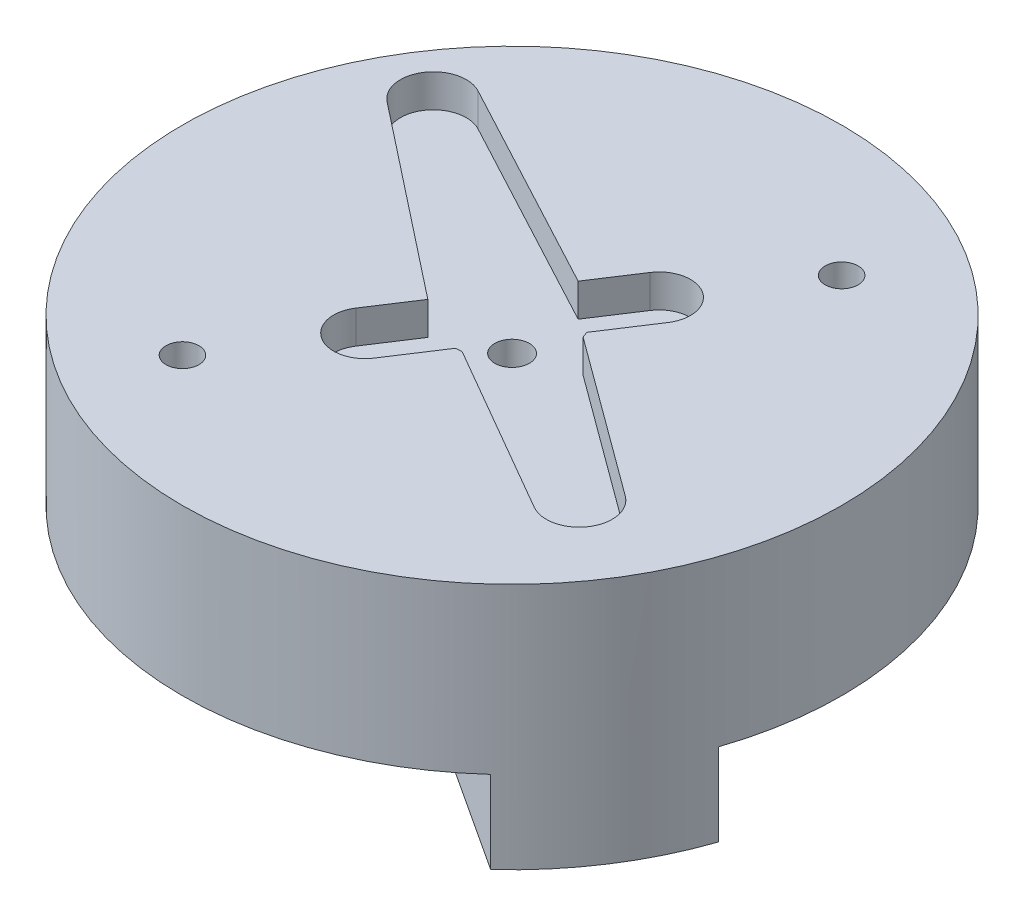
ISO-10303-21;
HEADER;
FILE_DESCRIPTION(('STEP AP214'),'2;1');
FILE_NAME('part.step','',(''),(''),'','','');
FILE_SCHEMA(('AUTOMOTIVE_DESIGN { 1 0 10303 214 1 1 1 1 }'));
ENDSEC;
DATA;
#1=APPLICATION_CONTEXT('core data for automotive mechanical design processes');
#2=APPLICATION_PROTOCOL_DEFINITION('international standard','automotive_design',2000,#1);
#3=PRODUCT_CONTEXT('',#1,'mechanical');
#4=PRODUCT('Part','Part','',(#3));
#5=PRODUCT_RELATED_PRODUCT_CATEGORY('part','',(#4));
#6=PRODUCT_DEFINITION_FORMATION('','',#4);
#7=PRODUCT_DEFINITION_CONTEXT('part definition',#1,'design');
#8=PRODUCT_DEFINITION('design','',#6,#7);
#9=PRODUCT_DEFINITION_SHAPE('','',#8);
#10=(LENGTH_UNIT() NAMED_UNIT(*) SI_UNIT(.MILLI.,.METRE.));
#11=(NAMED_UNIT(*) PLANE_ANGLE_UNIT() SI_UNIT($,.RADIAN.));
#12=(NAMED_UNIT(*) SI_UNIT($,.STERADIAN.) SOLID_ANGLE_UNIT());
#13=UNCERTAINTY_MEASURE_WITH_UNIT(LENGTH_MEASURE(1.E-05),#10,'distance_accuracy_value','');
#14=(GEOMETRIC_REPRESENTATION_CONTEXT(3) GLOBAL_UNCERTAINTY_ASSIGNED_CONTEXT((#13)) GLOBAL_UNIT_ASSIGNED_CONTEXT((#10,
#11,#12)) REPRESENTATION_CONTEXT('',''));
#15=CARTESIAN_POINT('',(0.,0.,0.));
#16=DIRECTION('',(0.,0.,1.));
#17=DIRECTION('',(1.,0.,0.));
#18=AXIS2_PLACEMENT_3D('',#15,#16,#17);
#19=CARTESIAN_POINT('',(-25.6510589348685,-8.,9.08811472367193));
#20=DIRECTION('',(0.,1.,0.));
#21=DIRECTION('',(0.,0.,1.));
#22=AXIS2_PLACEMENT_3D('',#19,#20,#21);
#23=CYLINDRICAL_SURFACE('',#22,2.3);
#24=CARTESIAN_POINT('',(-25.6510589348685,-8.,9.08811472367193));
#25=DIRECTION('',(0.,-1.,0.));
#26=DIRECTION('',(0.,0.,-1.));
#27=AXIS2_PLACEMENT_3D('',#24,#25,#26);
#28=CIRCLE('',#27,2.3);
#29=CARTESIAN_POINT('',(-27.5765478748303,-8.,7.83014320488275));
#30=VERTEX_POINT('',#29);
#31=CARTESIAN_POINT('',(-23.7255699949067,-8.,10.3460862424611));
#32=VERTEX_POINT('',#31);
#33=EDGE_CURVE('E253',#30,#32,#28,.T.);
#34=ORIENTED_EDGE('',*,*,#33,.T.);
#35=EDGE_CURVE('E252',#32,#30,#28,.T.);
#36=ORIENTED_EDGE('',*,*,#35,.T.);
#37=EDGE_LOOP('',(#34,#36));
#38=FACE_BOUND('',#37,.T.);
#39=CARTESIAN_POINT('',(-25.6510589348685,-2.,9.08811472367193));
#40=DIRECTION('',(0.,1.,0.));
#41=DIRECTION('',(0.,0.,1.));
#42=AXIS2_PLACEMENT_3D('',#39,#40,#41);
#43=CIRCLE('',#42,2.30000000000001);
#44=CARTESIAN_POINT('',(-25.6510589348685,-2.,11.3881147236719));
#45=VERTEX_POINT('',#44);
#46=EDGE_CURVE('E761',#45,#45,#43,.T.);
#47=ORIENTED_EDGE('',*,*,#46,.T.);
#48=EDGE_LOOP('',(#47));
#49=FACE_BOUND('',#48,.T.);
#50=ADVANCED_FACE('F38',(#38,#49),#23,.F.);
#51=CARTESIAN_POINT('',(-25.6510589348685,-8.,9.08811472367193));
#52=DIRECTION('',(0.,-1.,0.));
#53=DIRECTION('',(0.,0.,-1.));
#54=AXIS2_PLACEMENT_3D('',#51,#52,#53);
#55=PLANE('',#54);
#56=CARTESIAN_POINT('',(-17.7477161320408,-8.,-3.00897883391423));
#57=DIRECTION('',(0.,-1.,0.));
#58=DIRECTION('',(0.,0.,-1.));
#59=AXIS2_PLACEMENT_3D('',#56,#57,#58);
#60=CIRCLE('',#59,1.);
#61=CARTESIAN_POINT('',(-17.7477161320408,-8.,-4.00897883391424));
#62=VERTEX_POINT('',#61);
#63=EDGE_CURVE('E259',#62,#62,#60,.T.);
#64=ORIENTED_EDGE('',*,*,#63,.F.);
#65=EDGE_LOOP('',(#64));
#66=FACE_BOUND('',#65,.T.);
#67=CARTESIAN_POINT('',(-25.6510589348685,-8.,9.08811472367193));
#68=DIRECTION('',(0.,-1.,0.));
#69=DIRECTION('',(0.,0.,-1.));
#70=AXIS2_PLACEMENT_3D('',#67,#68,#69);
#71=CIRCLE('',#70,20.);
#72=CARTESIAN_POINT('',(-39.1280482370195,-8.,-5.68925849857922));
#73=VERTEX_POINT('',#72);
#74=CARTESIAN_POINT('',(-6.70462824667751,-8.,15.4937969026109));
#75=VERTEX_POINT('',#74);
#76=EDGE_CURVE('E263',#73,#75,#71,.T.);
#77=ORIENTED_EDGE('',*,*,#76,.T.);
#78=DIRECTION('',(0.837169104331222,0.,0.546944138603988));
#79=VECTOR('',#78,1.);
#80=CARTESIAN_POINT('',(-20.9908493018867,-8.,6.160240720805));
#81=LINE('',#80,#79);
#82=CARTESIAN_POINT('',(-20.9908493018867,-8.,6.160240720805));
#83=VERTEX_POINT('',#82);
#84=EDGE_CURVE('E219',#83,#75,#81,.T.);
#85=ORIENTED_EDGE('',*,*,#84,.F.);
#86=DIRECTION('',(0.546944138603988,0.,-0.837169104331222));
#87=VECTOR('',#86,1.);
#88=CARTESIAN_POINT('',(-23.7255699949067,-8.,10.3460862424611));
#89=LINE('',#88,#87);
#90=EDGE_CURVE('E753',#32,#83,#89,.T.);
#91=ORIENTED_EDGE('',*,*,#90,.F.);
#92=ORIENTED_EDGE('',*,*,#33,.F.);
#93=DIRECTION('',(-0.546944138603989,0.,0.837169104331222));
#94=VECTOR('',#93,1.);
#95=CARTESIAN_POINT('',(-27.5765478748303,-8.,7.83014320488276));
#96=LINE('',#95,#94);
#97=CARTESIAN_POINT('',(-24.8418271818103,-8.,3.64429768322665));
#98=VERTEX_POINT('',#97);
#99=EDGE_CURVE('E48',#98,#30,#96,.T.);
#100=ORIENTED_EDGE('',*,*,#99,.F.);
#101=DIRECTION('',(0.837169104331222,0.,0.546944138603989));
#102=VECTOR('',#101,1.);
#103=CARTESIAN_POINT('',(-24.8418271818103,-8.,3.64429768322665));
#104=LINE('',#103,#102);
#105=EDGE_CURVE('E222',#73,#98,#104,.T.);
#106=ORIENTED_EDGE('',*,*,#105,.F.);
#107=EDGE_LOOP('',(#77,#85,#91,#92,#100,#106));
#108=FACE_BOUND('',#107,.T.);
#109=ADVANCED_FACE('F453',(#66,#108),#55,.T.);
#110=CARTESIAN_POINT('',(-33.5544017376961,-8.,21.1852082812581));
#111=DIRECTION('',(0.,-1.,0.));
#112=DIRECTION('',(0.,0.,-1.));
#113=AXIS2_PLACEMENT_3D('',#110,#111,#112);
#114=CIRCLE('',#113,0.999999999999998);
#115=CARTESIAN_POINT('',(-33.5544017376961,-8.,20.1852082812581));
#116=VERTEX_POINT('',#115);
#117=EDGE_CURVE('E256',#116,#116,#114,.T.);
#118=ORIENTED_EDGE('',*,*,#117,.F.);
#119=EDGE_LOOP('',(#118));
#120=FACE_BOUND('',#119,.T.);
#121=CARTESIAN_POINT('',(-26.4602906879266,-8.,14.5319317641172));
#122=VERTEX_POINT('',#121);
#123=EDGE_CURVE('E215',#122,#32,#89,.T.);
#124=ORIENTED_EDGE('',*,*,#123,.F.);
#125=DIRECTION('',(-0.837169104331222,0.,-0.546944138603989));
#126=VECTOR('',#125,1.);
#127=CARTESIAN_POINT('',(-26.4602906879266,-8.,14.5319317641172));
#128=LINE('',#127,#126);
#129=CARTESIAN_POINT('',(-12.1740696327174,-8.,23.8654879459231));
#130=VERTEX_POINT('',#129);
#131=EDGE_CURVE('E751',#130,#122,#128,.T.);
#132=ORIENTED_EDGE('',*,*,#131,.F.);
#133=CARTESIAN_POINT('',(-44.5974896230594,-8.,2.68243254473301));
#134=VERTEX_POINT('',#133);
#135=EDGE_CURVE('E262',#130,#134,#71,.T.);
#136=ORIENTED_EDGE('',*,*,#135,.T.);
#137=DIRECTION('',(-0.837169104331223,0.,-0.546944138603988));
#138=VECTOR('',#137,1.);
#139=CARTESIAN_POINT('',(-30.3112685678502,-8.,12.0159887265389));
#140=LINE('',#139,#138);
#141=CARTESIAN_POINT('',(-30.3112685678502,-8.,12.0159887265389));
#142=VERTEX_POINT('',#141);
#143=EDGE_CURVE('E63',#142,#134,#140,.T.);
#144=ORIENTED_EDGE('',*,*,#143,.F.);
#145=EDGE_CURVE('E11',#30,#142,#96,.T.);
#146=ORIENTED_EDGE('',*,*,#145,.F.);
#147=ORIENTED_EDGE('',*,*,#35,.F.);
#148=EDGE_LOOP('',(#124,#132,#136,#144,#146,#147));
#149=FACE_BOUND('',#148,.T.);
#150=ADVANCED_FACE('F459',(#120,#149),#55,.T.);
#151=CARTESIAN_POINT('',(-22.1232692408727,2.,3.68837400073555));
#152=DIRECTION('',(0.,-1.,0.));
#153=DIRECTION('',(0.,0.,-1.));
#154=AXIS2_PLACEMENT_3D('',#151,#152,#153);
#155=CYLINDRICAL_SURFACE('',#154,1.89999999999997);
#156=CARTESIAN_POINT('',(-22.1232692408727,0.,3.68837400073555));
#157=DIRECTION('',(0.,1.,0.));
#158=DIRECTION('',(0.,0.,1.));
#159=AXIS2_PLACEMENT_3D('',#156,#157,#158);
#160=CIRCLE('',#159,1.89999999999997);
#161=CARTESIAN_POINT('',(-20.5326479426435,0.,4.7275678640831));
#162=VERTEX_POINT('',#161);
#163=CARTESIAN_POINT('',(-23.7138905391021,0.,2.64918013738797));
#164=VERTEX_POINT('',#163);
#165=EDGE_CURVE('E265',#162,#164,#160,.T.);
#166=ORIENTED_EDGE('',*,*,#165,.F.);
#167=DIRECTION('',(0.,-1.,0.));
#168=VECTOR('',#167,1.);
#169=CARTESIAN_POINT('',(-20.5326479426435,2.,4.7275678640831));
#170=LINE('',#169,#168);
#171=CARTESIAN_POINT('',(-20.5326479426435,2.,4.7275678640831));
#172=VERTEX_POINT('',#171);
#173=EDGE_CURVE('E42',#172,#162,#170,.T.);
#174=ORIENTED_EDGE('',*,*,#173,.F.);
#175=CARTESIAN_POINT('',(-22.1232692408727,2.,3.68837400073555));
#176=DIRECTION('',(0.,1.,0.));
#177=DIRECTION('',(0.,0.,1.));
#178=AXIS2_PLACEMENT_3D('',#175,#176,#177);
#179=CIRCLE('',#178,1.89999999999997);
#180=CARTESIAN_POINT('',(-23.7138905391021,2.,2.64918013738797));
#181=VERTEX_POINT('',#180);
#182=EDGE_CURVE('E273',#172,#181,#179,.T.);
#183=ORIENTED_EDGE('',*,*,#182,.T.);
#184=DIRECTION('',(0.,-1.,0.));
#185=VECTOR('',#184,1.);
#186=CARTESIAN_POINT('',(-23.7138905391021,2.,2.64918013738797));
#187=LINE('',#186,#185);
#188=EDGE_CURVE('E317',#181,#164,#187,.T.);
#189=ORIENTED_EDGE('',*,*,#188,.T.);
#190=EDGE_LOOP('',(#166,#174,#183,#189));
#191=FACE_BOUND('',#190,.T.);
#192=ADVANCED_FACE('F406',(#191),#155,.F.);
#193=CARTESIAN_POINT('',(-12.225668462111,2.,-7.98734409962373));
#194=DIRECTION('',(-0.837169104331222,0.,-0.546944138603988));
#195=DIRECTION('',(-0.546944138603988,0.,0.837169104331222));
#196=AXIS2_PLACEMENT_3D('',#193,#194,#195);
#197=PLANE('',#196);
#198=DIRECTION('',(0.546944138603988,0.,-0.837169104331222));
#199=VECTOR('',#198,1.);
#200=CARTESIAN_POINT('',(-12.225668462111,0.,-7.98734409962373));
#201=LINE('',#200,#199);
#202=CARTESIAN_POINT('',(-22.4854189433941,0.,7.71653773189272));
#203=VERTEX_POINT('',#202);
#204=EDGE_CURVE('E320',#203,#162,#201,.T.);
#205=ORIENTED_EDGE('',*,*,#204,.F.);
#206=DIRECTION('',(0.,-1.,0.));
#207=VECTOR('',#206,1.);
#208=CARTESIAN_POINT('',(-22.4854189433941,2.,7.71653773189272));
#209=LINE('',#208,#207);
#210=CARTESIAN_POINT('',(-22.4854189433941,2.,7.71653773189272));
#211=VERTEX_POINT('',#210);
#212=EDGE_CURVE('E380',#211,#203,#209,.T.);
#213=ORIENTED_EDGE('',*,*,#212,.F.);
#214=DIRECTION('',(0.546944138603988,0.,-0.837169104331222));
#215=VECTOR('',#214,1.);
#216=CARTESIAN_POINT('',(-12.225668462111,2.,-7.98734409962373));
#217=LINE('',#216,#215);
#218=EDGE_CURVE('E276',#211,#172,#217,.T.);
#219=ORIENTED_EDGE('',*,*,#218,.T.);
#220=ORIENTED_EDGE('',*,*,#173,.T.);
#221=EDGE_LOOP('',(#205,#213,#219,#220));
#222=FACE_BOUND('',#221,.T.);
#223=ADVANCED_FACE('F386',(#222),#197,.T.);
#224=CARTESIAN_POINT('',(-22.3010554179395,2.,8.21690854366014));
#225=DIRECTION('',(-0.938333149525754,0.,0.345732411701709));
#226=DIRECTION('',(0.345732411701709,0.,0.938333149525754));
#227=AXIS2_PLACEMENT_3D('',#224,#225,#226);
#228=PLANE('',#227);
#229=DIRECTION('',(-0.345732411701709,0.,-0.938333149525754));
#230=VECTOR('',#229,1.);
#231=CARTESIAN_POINT('',(-22.3010554179395,0.,8.21690854366014));
#232=LINE('',#231,#230);
#233=CARTESIAN_POINT('',(-22.3522899696132,0.,8.07785569061723));
#234=VERTEX_POINT('',#233);
#235=EDGE_CURVE('E323',#234,#203,#232,.T.);
#236=ORIENTED_EDGE('',*,*,#235,.F.);
#237=DIRECTION('',(0.,-1.,0.));
#238=VECTOR('',#237,1.);
#239=CARTESIAN_POINT('',(-22.3522899696132,2.,8.07785569061723));
#240=LINE('',#239,#238);
#241=CARTESIAN_POINT('',(-22.3522899696132,2.,8.07785569061723));
#242=VERTEX_POINT('',#241);
#243=EDGE_CURVE('E379',#242,#234,#240,.T.);
#244=ORIENTED_EDGE('',*,*,#243,.F.);
#245=DIRECTION('',(-0.345732411701709,0.,-0.938333149525754));
#246=VECTOR('',#245,1.);
#247=CARTESIAN_POINT('',(-22.3010554179395,2.,8.21690854366014));
#248=LINE('',#247,#246);
#249=EDGE_CURVE('E279',#242,#211,#248,.T.);
#250=ORIENTED_EDGE('',*,*,#249,.T.);
#251=ORIENTED_EDGE('',*,*,#212,.T.);
#252=EDGE_LOOP('',(#236,#244,#250,#251));
#253=FACE_BOUND('',#252,.T.);
#254=ADVANCED_FACE('F394',(#253),#228,.T.);
#255=CARTESIAN_POINT('',(-11.6820319266895,2.,15.9117216725028));
#256=DIRECTION('',(0.591806202277593,0.,-0.806080280707681));
#257=DIRECTION('',(-0.806080280707681,0.,-0.591806202277593));
#258=AXIS2_PLACEMENT_3D('',#255,#256,#257);
#259=PLANE('',#258);
#260=DIRECTION('',(0.806080280707681,0.,0.591806202277593));
#261=VECTOR('',#260,1.);
#262=CARTESIAN_POINT('',(-11.6820319266895,0.,15.9117216725028));
#263=LINE('',#262,#261);
#264=CARTESIAN_POINT('',(-12.7052206144597,0.,15.1605193096425));
#265=VERTEX_POINT('',#264);
#266=EDGE_CURVE('E326',#234,#265,#263,.T.);
#267=ORIENTED_EDGE('',*,*,#266,.T.);
#268=DIRECTION('',(0.,-1.,0.));
#269=VECTOR('',#268,1.);
#270=CARTESIAN_POINT('',(-12.7052206144597,2.,15.1605193096425));
#271=LINE('',#270,#269);
#272=CARTESIAN_POINT('',(-12.7052206144597,2.,15.1605193096425));
#273=VERTEX_POINT('',#272);
#274=EDGE_CURVE('E377',#273,#265,#271,.T.);
#275=ORIENTED_EDGE('',*,*,#274,.F.);
#276=DIRECTION('',(0.806080280707681,0.,0.591806202277593));
#277=VECTOR('',#276,1.);
#278=CARTESIAN_POINT('',(-11.6820319266895,2.,15.9117216725028));
#279=LINE('',#278,#277);
#280=EDGE_CURVE('E282',#242,#273,#279,.T.);
#281=ORIENTED_EDGE('',*,*,#280,.F.);
#282=ORIENTED_EDGE('',*,*,#243,.T.);
#283=EDGE_LOOP('',(#267,#275,#281,#282));
#284=FACE_BOUND('',#283,.T.);
#285=ADVANCED_FACE('F399',(#284),#259,.F.);
#286=CARTESIAN_POINT('',(-13.8888330190148,2.,16.772679871058));
#287=DIRECTION('',(0.,-1.,0.));
#288=DIRECTION('',(0.,0.,-1.));
#289=AXIS2_PLACEMENT_3D('',#286,#287,#288);
#290=CYLINDRICAL_SURFACE('',#289,2.00000000000003);
#291=CARTESIAN_POINT('',(-13.8888330190148,0.,16.772679871058));
#292=DIRECTION('',(0.,1.,0.));
#293=DIRECTION('',(0.,0.,1.));
#294=AXIS2_PLACEMENT_3D('',#291,#292,#293);
#295=CIRCLE('',#294,2.00000000000003);
#296=CARTESIAN_POINT('',(-14.889738344747,0.,18.5042076730066));
#297=VERTEX_POINT('',#296);
#298=EDGE_CURVE('E329',#297,#265,#295,.T.);
#299=ORIENTED_EDGE('',*,*,#298,.F.);
#300=DIRECTION('',(0.,-1.,0.));
#301=VECTOR('',#300,1.);
#302=CARTESIAN_POINT('',(-14.889738344747,2.,18.5042076730066));
#303=LINE('',#302,#301);
#304=CARTESIAN_POINT('',(-14.889738344747,2.,18.5042076730066));
#305=VERTEX_POINT('',#304);
#306=EDGE_CURVE('E375',#305,#297,#303,.T.);
#307=ORIENTED_EDGE('',*,*,#306,.F.);
#308=CARTESIAN_POINT('',(-13.8888330190148,2.,16.772679871058));
#309=DIRECTION('',(0.,1.,0.));
#310=DIRECTION('',(0.,0.,1.));
#311=AXIS2_PLACEMENT_3D('',#308,#309,#310);
#312=CIRCLE('',#311,2.00000000000003);
#313=EDGE_CURVE('E284',#305,#273,#312,.T.);
#314=ORIENTED_EDGE('',*,*,#313,.T.);
#315=ORIENTED_EDGE('',*,*,#274,.T.);
#316=EDGE_LOOP('',(#299,#307,#314,#315));
#317=FACE_BOUND('',#316,.T.);
#318=ADVANCED_FACE('F443',(#317),#290,.F.);
#319=CARTESIAN_POINT('',(-11.7465669620987,2.,20.3211100484931));
#320=DIRECTION('',(0.500452662866061,0.,-0.865763900974318));
#321=DIRECTION('',(-0.865763900974318,0.,-0.500452662866061));
#322=AXIS2_PLACEMENT_3D('',#319,#320,#321);
#323=PLANE('',#322);
#324=DIRECTION('',(0.865763900974318,0.,0.500452662866061));
#325=VECTOR('',#324,1.);
#326=CARTESIAN_POINT('',(-11.7465669620987,0.,20.3211100484931));
#327=LINE('',#326,#325);
#328=CARTESIAN_POINT('',(-25.2510939042143,0.,12.5148519435728));
#329=VERTEX_POINT('',#328);
#330=EDGE_CURVE('E332',#329,#297,#327,.T.);
#331=ORIENTED_EDGE('',*,*,#330,.F.);
#332=DIRECTION('',(0.,-1.,0.));
#333=VECTOR('',#332,1.);
#334=CARTESIAN_POINT('',(-25.2510939042143,2.,12.5148519435728));
#335=LINE('',#334,#333);
#336=CARTESIAN_POINT('',(-25.2510939042143,2.,12.5148519435728));
#337=VERTEX_POINT('',#336);
#338=EDGE_CURVE('E373',#337,#329,#335,.T.);
#339=ORIENTED_EDGE('',*,*,#338,.F.);
#340=DIRECTION('',(0.865763900974318,0.,0.500452662866061));
#341=VECTOR('',#340,1.);
#342=CARTESIAN_POINT('',(-11.7465669620987,2.,20.3211100484931));
#343=LINE('',#342,#341);
#344=EDGE_CURVE('E287',#337,#305,#343,.T.);
#345=ORIENTED_EDGE('',*,*,#344,.T.);
#346=ORIENTED_EDGE('',*,*,#306,.T.);
#347=EDGE_LOOP('',(#331,#339,#345,#346));
#348=FACE_BOUND('',#347,.T.);
#349=ADVANCED_FACE('F440',(#348),#323,.T.);
#350=CARTESIAN_POINT('',(0.661656361916206,2.,10.9489122740211));
#351=DIRECTION('',(-0.0603211973437465,0.,-0.998179018588859));
#352=DIRECTION('',(-0.998179018588859,0.,0.0603211973437465));
#353=AXIS2_PLACEMENT_3D('',#350,#351,#352);
#354=PLANE('',#353);
#355=DIRECTION('',(0.998179018588859,0.,-0.0603211973437465));
#356=VECTOR('',#355,1.);
#357=CARTESIAN_POINT('',(0.661656361916206,0.,10.9489122740211));
#358=LINE('',#357,#356);
#359=CARTESIAN_POINT('',(-25.6354563298842,0.,12.5380794421463));
#360=VERTEX_POINT('',#359);
#361=EDGE_CURVE('E335',#360,#329,#358,.T.);
#362=ORIENTED_EDGE('',*,*,#361,.F.);
#363=DIRECTION('',(0.,-1.,0.));
#364=VECTOR('',#363,1.);
#365=CARTESIAN_POINT('',(-25.6354563298842,2.,12.5380794421463));
#366=LINE('',#365,#364);
#367=CARTESIAN_POINT('',(-25.6354563298842,2.,12.5380794421463));
#368=VERTEX_POINT('',#367);
#369=EDGE_CURVE('E371',#368,#360,#366,.T.);
#370=ORIENTED_EDGE('',*,*,#369,.F.);
#371=DIRECTION('',(0.998179018588859,0.,-0.0603211973437465));
#372=VECTOR('',#371,1.);
#373=CARTESIAN_POINT('',(0.661656361916206,2.,10.9489122740211));
#374=LINE('',#373,#372);
#375=EDGE_CURVE('E290',#368,#337,#374,.T.);
#376=ORIENTED_EDGE('',*,*,#375,.T.);
#377=ORIENTED_EDGE('',*,*,#338,.T.);
#378=EDGE_LOOP('',(#362,#370,#376,#377));
#379=FACE_BOUND('',#378,.T.);
#380=ADVANCED_FACE('F436',(#379),#354,.T.);
#381=CARTESIAN_POINT('',(-12.225668462111,2.,-7.9873440996237));
#382=DIRECTION('',(-0.837169104331223,0.,-0.546944138603987));
#383=DIRECTION('',(-0.546944138603987,0.,0.837169104331223));
#384=AXIS2_PLACEMENT_3D('',#381,#382,#383);
#385=PLANE('',#384);
#386=DIRECTION('',(0.546944138603987,0.,-0.837169104331223));
#387=VECTOR('',#386,1.);
#388=CARTESIAN_POINT('',(-12.225668462111,0.,-7.9873440996237));
#389=LINE('',#388,#387);
#390=CARTESIAN_POINT('',(-27.5882273306349,0.,15.5270493099559));
#391=VERTEX_POINT('',#390);
#392=EDGE_CURVE('E338',#391,#360,#389,.T.);
#393=ORIENTED_EDGE('',*,*,#392,.F.);
#394=DIRECTION('',(0.,-1.,0.));
#395=VECTOR('',#394,1.);
#396=CARTESIAN_POINT('',(-27.5882273306349,2.,15.5270493099559));
#397=LINE('',#396,#395);
#398=CARTESIAN_POINT('',(-27.5882273306349,2.,15.5270493099559));
#399=VERTEX_POINT('',#398);
#400=EDGE_CURVE('E369',#399,#391,#397,.T.);
#401=ORIENTED_EDGE('',*,*,#400,.F.);
#402=DIRECTION('',(0.546944138603987,0.,-0.837169104331223));
#403=VECTOR('',#402,1.);
#404=CARTESIAN_POINT('',(-12.225668462111,2.,-7.9873440996237));
#405=LINE('',#404,#403);
#406=EDGE_CURVE('E293',#399,#368,#405,.T.);
#407=ORIENTED_EDGE('',*,*,#406,.T.);
#408=ORIENTED_EDGE('',*,*,#369,.T.);
#409=EDGE_LOOP('',(#393,#401,#407,#408));
#410=FACE_BOUND('',#409,.T.);
#411=ADVANCED_FACE('F432',(#410),#385,.T.);
#412=CARTESIAN_POINT('',(-29.1788486288642,2.,14.4878554466083));
#413=DIRECTION('',(0.,-1.,0.));
#414=DIRECTION('',(0.,0.,-1.));
#415=AXIS2_PLACEMENT_3D('',#412,#413,#414);
#416=CYLINDRICAL_SURFACE('',#415,1.90000000000002);
#417=CARTESIAN_POINT('',(-29.1788486288642,0.,14.4878554466083));
#418=DIRECTION('',(0.,1.,0.));
#419=DIRECTION('',(0.,0.,1.));
#420=AXIS2_PLACEMENT_3D('',#417,#418,#419);
#421=CIRCLE('',#420,1.90000000000002);
#422=CARTESIAN_POINT('',(-30.7694699270935,0.,13.4486615832607));
#423=VERTEX_POINT('',#422);
#424=EDGE_CURVE('E341',#423,#391,#421,.T.);
#425=ORIENTED_EDGE('',*,*,#424,.F.);
#426=DIRECTION('',(0.,-1.,0.));
#427=VECTOR('',#426,1.);
#428=CARTESIAN_POINT('',(-30.7694699270935,2.,13.4486615832607));
#429=LINE('',#428,#427);
#430=CARTESIAN_POINT('',(-30.7694699270935,2.,13.4486615832607));
#431=VERTEX_POINT('',#430);
#432=EDGE_CURVE('E367',#431,#423,#429,.T.);
#433=ORIENTED_EDGE('',*,*,#432,.F.);
#434=CARTESIAN_POINT('',(-29.1788486288642,2.,14.4878554466083));
#435=DIRECTION('',(0.,1.,0.));
#436=DIRECTION('',(0.,0.,1.));
#437=AXIS2_PLACEMENT_3D('',#434,#435,#436);
#438=CIRCLE('',#437,1.90000000000002);
#439=EDGE_CURVE('E296',#431,#399,#438,.T.);
#440=ORIENTED_EDGE('',*,*,#439,.T.);
#441=ORIENTED_EDGE('',*,*,#400,.T.);
#442=EDGE_LOOP('',(#425,#433,#440,#441));
#443=FACE_BOUND('',#442,.T.);
#444=ADVANCED_FACE('F428',(#443),#416,.F.);
#445=CARTESIAN_POINT('',(-15.4069110585695,2.,-10.0657318263189));
#446=DIRECTION('',(0.837169104331219,0.,0.546944138603993));
#447=DIRECTION('',(0.546944138603993,0.,-0.837169104331219));
#448=AXIS2_PLACEMENT_3D('',#445,#446,#447);
#449=PLANE('',#448);
#450=DIRECTION('',(-0.546944138603993,0.,0.837169104331219));
#451=VECTOR('',#450,1.);
#452=CARTESIAN_POINT('',(-15.4069110585695,0.,-10.0657318263189));
#453=LINE('',#452,#451);
#454=CARTESIAN_POINT('',(-29.0440524350782,0.,10.8076858154708));
#455=VERTEX_POINT('',#454);
#456=EDGE_CURVE('E344',#455,#423,#453,.T.);
#457=ORIENTED_EDGE('',*,*,#456,.F.);
#458=DIRECTION('',(0.,-1.,0.));
#459=VECTOR('',#458,1.);
#460=CARTESIAN_POINT('',(-29.0440524350782,2.,10.8076858154708));
#461=LINE('',#460,#459);
#462=CARTESIAN_POINT('',(-29.0440524350782,2.,10.8076858154708));
#463=VERTEX_POINT('',#462);
#464=EDGE_CURVE('E365',#463,#455,#461,.T.);
#465=ORIENTED_EDGE('',*,*,#464,.F.);
#466=DIRECTION('',(-0.546944138603993,0.,0.837169104331219));
#467=VECTOR('',#466,1.);
#468=CARTESIAN_POINT('',(-15.4069110585695,2.,-10.0657318263189));
#469=LINE('',#468,#467);
#470=EDGE_CURVE('E299',#463,#431,#469,.T.);
#471=ORIENTED_EDGE('',*,*,#470,.T.);
#472=ORIENTED_EDGE('',*,*,#432,.T.);
#473=EDGE_LOOP('',(#457,#465,#471,#472));
#474=FACE_BOUND('',#473,.T.);
#475=ADVANCED_FACE('F424',(#474),#449,.T.);
#476=CARTESIAN_POINT('',(-16.3674357638219,2.,20.7884204853247));
#477=DIRECTION('',(0.618608220900555,0.,-0.785699604832693));
#478=DIRECTION('',(-0.785699604832693,0.,-0.618608220900555));
#479=AXIS2_PLACEMENT_3D('',#476,#477,#478);
#480=PLANE('',#479);
#481=DIRECTION('',(0.785699604832693,0.,0.618608220900555));
#482=VECTOR('',#481,1.);
#483=CARTESIAN_POINT('',(-16.3674357638219,0.,20.7884204853247));
#484=LINE('',#483,#482);
#485=CARTESIAN_POINT('',(-40.6597071429182,0.,1.66228285330166));
#486=VERTEX_POINT('',#485);
#487=EDGE_CURVE('E347',#486,#455,#484,.T.);
#488=ORIENTED_EDGE('',*,*,#487,.F.);
#489=DIRECTION('',(0.,-1.,0.));
#490=VECTOR('',#489,1.);
#491=CARTESIAN_POINT('',(-40.6597071429182,2.,1.66228285330166));
#492=LINE('',#491,#490);
#493=CARTESIAN_POINT('',(-40.6597071429182,2.,1.66228285330166));
#494=VERTEX_POINT('',#493);
#495=EDGE_CURVE('E363',#494,#486,#492,.T.);
#496=ORIENTED_EDGE('',*,*,#495,.F.);
#497=DIRECTION('',(0.785699604832693,0.,0.618608220900555));
#498=VECTOR('',#497,1.);
#499=CARTESIAN_POINT('',(-16.3674357638219,2.,20.7884204853247));
#500=LINE('',#499,#498);
#501=EDGE_CURVE('E302',#494,#463,#500,.T.);
#502=ORIENTED_EDGE('',*,*,#501,.T.);
#503=ORIENTED_EDGE('',*,*,#464,.T.);
#504=EDGE_LOOP('',(#488,#496,#502,#503));
#505=FACE_BOUND('',#504,.T.);
#506=ADVANCED_FACE('F420',(#505),#480,.T.);
#507=CARTESIAN_POINT('',(-39.4224907011171,2.,0.0908836436363104));
#508=DIRECTION('',(0.,-1.,0.));
#509=DIRECTION('',(0.,0.,-1.));
#510=AXIS2_PLACEMENT_3D('',#507,#508,#509);
#511=CYLINDRICAL_SURFACE('',#510,2.00000000000001);
#512=CARTESIAN_POINT('',(-39.4224907011171,0.,0.0908836436363104));
#513=DIRECTION('',(0.,1.,0.));
#514=DIRECTION('',(0.,0.,1.));
#515=AXIS2_PLACEMENT_3D('',#512,#513,#514);
#516=CIRCLE('',#515,2.00000000000001);
#517=CARTESIAN_POINT('',(-38.4804463447337,0.,-1.67335909210226));
#518=VERTEX_POINT('',#517);
#519=EDGE_CURVE('E350',#518,#486,#516,.T.);
#520=ORIENTED_EDGE('',*,*,#519,.F.);
#521=DIRECTION('',(0.,-1.,0.));
#522=VECTOR('',#521,1.);
#523=CARTESIAN_POINT('',(-38.4804463447337,2.,-1.67335909210226));
#524=LINE('',#523,#522);
#525=CARTESIAN_POINT('',(-38.4804463447337,2.,-1.67335909210226));
#526=VERTEX_POINT('',#525);
#527=EDGE_CURVE('E361',#526,#518,#524,.T.);
#528=ORIENTED_EDGE('',*,*,#527,.F.);
#529=CARTESIAN_POINT('',(-39.4224907011171,2.,0.0908836436363104));
#530=DIRECTION('',(0.,1.,0.));
#531=DIRECTION('',(0.,0.,1.));
#532=AXIS2_PLACEMENT_3D('',#529,#530,#531);
#533=CIRCLE('',#532,2.00000000000001);
#534=EDGE_CURVE('E305',#526,#494,#533,.T.);
#535=ORIENTED_EDGE('',*,*,#534,.T.);
#536=ORIENTED_EDGE('',*,*,#495,.T.);
#537=EDGE_LOOP('',(#520,#528,#535,#536));
#538=FACE_BOUND('',#537,.T.);
#539=ADVANCED_FACE('F416',(#538),#511,.F.);
#540=CARTESIAN_POINT('',(-7.84206606999412,2.,14.6864720365011));
#541=DIRECTION('',(-0.471022178191708,0.,0.882121367869262));
#542=DIRECTION('',(0.882121367869262,0.,0.471022178191708));
#543=AXIS2_PLACEMENT_3D('',#540,#541,#542);
#544=PLANE('',#543);
#545=DIRECTION('',(-0.882121367869262,0.,-0.471022178191708));
#546=VECTOR('',#545,1.);
#547=CARTESIAN_POINT('',(-7.84206606999412,0.,14.6864720365011));
#548=LINE('',#547,#546);
#549=CARTESIAN_POINT('',(-25.4393080311174,0.,5.2901559051779));
#550=VERTEX_POINT('',#549);
#551=EDGE_CURVE('E353',#550,#518,#548,.T.);
#552=ORIENTED_EDGE('',*,*,#551,.F.);
#553=DIRECTION('',(0.,-1.,0.));
#554=VECTOR('',#553,1.);
#555=CARTESIAN_POINT('',(-25.4393080311174,2.,5.2901559051779));
#556=LINE('',#555,#554);
#557=CARTESIAN_POINT('',(-25.4393080311174,2.,5.2901559051779));
#558=VERTEX_POINT('',#557);
#559=EDGE_CURVE('E359',#558,#550,#556,.T.);
#560=ORIENTED_EDGE('',*,*,#559,.F.);
#561=DIRECTION('',(-0.882121367869262,0.,-0.471022178191708));
#562=VECTOR('',#561,1.);
#563=CARTESIAN_POINT('',(-7.84206606999412,2.,14.6864720365011));
#564=LINE('',#563,#562);
#565=EDGE_CURVE('E308',#558,#526,#564,.T.);
#566=ORIENTED_EDGE('',*,*,#565,.T.);
#567=ORIENTED_EDGE('',*,*,#527,.T.);
#568=EDGE_LOOP('',(#552,#560,#566,#567));
#569=FACE_BOUND('',#568,.T.);
#570=ADVANCED_FACE('F413',(#569),#544,.T.);
#571=CARTESIAN_POINT('',(-15.4069110585697,2.,-10.0657318263188));
#572=DIRECTION('',(0.837169104331223,0.,0.546944138603988));
#573=DIRECTION('',(0.546944138603988,0.,-0.837169104331223));
#574=AXIS2_PLACEMENT_3D('',#571,#572,#573);
#575=PLANE('',#574);
#576=DIRECTION('',(-0.546944138603988,0.,0.837169104331223));
#577=VECTOR('',#576,1.);
#578=CARTESIAN_POINT('',(-15.4069110585697,0.,-10.0657318263188));
#579=LINE('',#578,#577);
#580=EDGE_CURVE('E270',#164,#550,#579,.T.);
#581=ORIENTED_EDGE('',*,*,#580,.F.);
#582=ORIENTED_EDGE('',*,*,#188,.F.);
#583=DIRECTION('',(-0.546944138603988,0.,0.837169104331223));
#584=VECTOR('',#583,1.);
#585=CARTESIAN_POINT('',(-15.4069110585697,2.,-10.0657318263188));
#586=LINE('',#585,#584);
#587=EDGE_CURVE('E311',#181,#558,#586,.T.);
#588=ORIENTED_EDGE('',*,*,#587,.T.);
#589=ORIENTED_EDGE('',*,*,#559,.T.);
#590=EDGE_LOOP('',(#581,#582,#588,#589));
#591=FACE_BOUND('',#590,.T.);
#592=ADVANCED_FACE('F409',(#591),#575,.T.);
#593=CARTESIAN_POINT('',(-33.5544017376961,2.,21.1852082812581));
#594=DIRECTION('',(0.,-1.,0.));
#595=DIRECTION('',(0.,0.,-1.));
#596=AXIS2_PLACEMENT_3D('',#593,#594,#595);
#597=CYLINDRICAL_SURFACE('',#596,0.999999999999998);
#598=CARTESIAN_POINT('',(-33.5544017376961,2.,21.1852082812581));
#599=DIRECTION('',(0.,1.,0.));
#600=DIRECTION('',(0.,0.,1.));
#601=AXIS2_PLACEMENT_3D('',#598,#599,#600);
#602=CIRCLE('',#601,0.999999999999998);
#603=CARTESIAN_POINT('',(-33.5544017376961,2.,22.1852082812581));
#604=VERTEX_POINT('',#603);
#605=EDGE_CURVE('E269',#604,#604,#602,.T.);
#606=ORIENTED_EDGE('',*,*,#605,.T.);
#607=EDGE_LOOP('',(#606));
#608=FACE_BOUND('',#607,.T.);
#609=ORIENTED_EDGE('',*,*,#117,.T.);
#610=EDGE_LOOP('',(#609));
#611=FACE_BOUND('',#610,.T.);
#612=ADVANCED_FACE('F477',(#608,#611),#597,.F.);
#613=CARTESIAN_POINT('',(-17.7477161320408,2.,-3.00897883391423));
#614=DIRECTION('',(0.,-1.,0.));
#615=DIRECTION('',(0.,0.,-1.));
#616=AXIS2_PLACEMENT_3D('',#613,#614,#615);
#617=CYLINDRICAL_SURFACE('',#616,1.);
#618=CARTESIAN_POINT('',(-17.7477161320408,2.,-3.00897883391423));
#619=DIRECTION('',(0.,1.,0.));
#620=DIRECTION('',(0.,0.,1.));
#621=AXIS2_PLACEMENT_3D('',#618,#619,#620);
#622=CIRCLE('',#621,1.);
#623=CARTESIAN_POINT('',(-17.7477161320408,2.,-2.00897883391423));
#624=VERTEX_POINT('',#623);
#625=EDGE_CURVE('E266',#624,#624,#622,.T.);
#626=ORIENTED_EDGE('',*,*,#625,.T.);
#627=EDGE_LOOP('',(#626));
#628=FACE_BOUND('',#627,.T.);
#629=ORIENTED_EDGE('',*,*,#63,.T.);
#630=EDGE_LOOP('',(#629));
#631=FACE_BOUND('',#630,.T.);
#632=ADVANCED_FACE('F40',(#628,#631),#617,.F.);
#633=CARTESIAN_POINT('',(-25.6510589348685,2.,9.08811472367193));
#634=DIRECTION('',(0.,-1.,0.));
#635=DIRECTION('',(0.,0.,-1.));
#636=AXIS2_PLACEMENT_3D('',#633,#634,#635);
#637=CYLINDRICAL_SURFACE('',#636,20.);
#638=CARTESIAN_POINT('',(-25.6510589348685,2.,9.08811472367193));
#639=DIRECTION('',(0.,1.,0.));
#640=DIRECTION('',(0.,0.,1.));
#641=AXIS2_PLACEMENT_3D('',#638,#639,#640);
#642=CIRCLE('',#641,20.);
#643=CARTESIAN_POINT('',(-25.6510589348685,2.,29.0881147236719));
#644=VERTEX_POINT('',#643);
#645=EDGE_CURVE('E314',#644,#644,#642,.T.);
#646=ORIENTED_EDGE('',*,*,#645,.F.);
#647=EDGE_LOOP('',(#646));
#648=FACE_BOUND('',#647,.T.);
#649=ORIENTED_EDGE('',*,*,#76,.F.);
#650=DIRECTION('',(0.,1.,0.));
#651=VECTOR('',#650,1.);
#652=CARTESIAN_POINT('',(-39.1280482370195,-13.,-5.68925849857922));
#653=LINE('',#652,#651);
#654=CARTESIAN_POINT('',(-39.1280482370195,-13.,-5.68925849857922));
#655=VERTEX_POINT('',#654);
#656=EDGE_CURVE('E243',#655,#73,#653,.T.);
#657=ORIENTED_EDGE('',*,*,#656,.F.);
#658=CARTESIAN_POINT('',(-25.6510589348685,-13.,9.08811472367193));
#659=DIRECTION('',(0.,-1.,0.));
#660=DIRECTION('',(0.,0.,1.));
#661=AXIS2_PLACEMENT_3D('',#658,#659,#660);
#662=CIRCLE('',#661,20.);
#663=CARTESIAN_POINT('',(-44.5974896230594,-13.,2.68243254473302));
#664=VERTEX_POINT('',#663);
#665=EDGE_CURVE('E232',#664,#655,#662,.T.);
#666=ORIENTED_EDGE('',*,*,#665,.F.);
#667=DIRECTION('',(0.,1.,0.));
#668=VECTOR('',#667,1.);
#669=CARTESIAN_POINT('',(-44.5974896230594,-13.,2.68243254473302));
#670=LINE('',#669,#668);
#671=EDGE_CURVE('E246',#664,#134,#670,.T.);
#672=ORIENTED_EDGE('',*,*,#671,.T.);
#673=ORIENTED_EDGE('',*,*,#135,.F.);
#674=DIRECTION('',(0.,1.,0.));
#675=VECTOR('',#674,1.);
#676=CARTESIAN_POINT('',(-12.1740696327174,-13.,23.8654879459231));
#677=LINE('',#676,#675);
#678=CARTESIAN_POINT('',(-12.1740696327174,-13.,23.8654879459231));
#679=VERTEX_POINT('',#678);
#680=EDGE_CURVE('E203',#679,#130,#677,.T.);
#681=ORIENTED_EDGE('',*,*,#680,.F.);
#682=CARTESIAN_POINT('',(-25.6510589348685,-13.,9.08811472367193));
#683=DIRECTION('',(0.,-1.,0.));
#684=DIRECTION('',(0.,0.,-1.));
#685=AXIS2_PLACEMENT_3D('',#682,#683,#684);
#686=CIRCLE('',#685,20.);
#687=CARTESIAN_POINT('',(-6.70462824667751,-13.,15.4937969026109));
#688=VERTEX_POINT('',#687);
#689=EDGE_CURVE('E195',#688,#679,#686,.T.);
#690=ORIENTED_EDGE('',*,*,#689,.F.);
#691=DIRECTION('',(0.,1.,0.));
#692=VECTOR('',#691,1.);
#693=CARTESIAN_POINT('',(-6.70462824667751,-13.,15.4937969026109));
#694=LINE('',#693,#692);
#695=EDGE_CURVE('E200',#688,#75,#694,.T.);
#696=ORIENTED_EDGE('',*,*,#695,.T.);
#697=EDGE_LOOP('',(#649,#657,#666,#672,#673,#681,#690,#696));
#698=FACE_BOUND('',#697,.T.);
#699=ADVANCED_FACE('F198',(#648,#698),#637,.T.);
#700=CARTESIAN_POINT('',(0.,2.,0.));
#701=DIRECTION('',(0.,1.,0.));
#702=DIRECTION('',(0.,0.,1.));
#703=AXIS2_PLACEMENT_3D('',#700,#701,#702);
#704=PLANE('',#703);
#705=ORIENTED_EDGE('',*,*,#625,.F.);
#706=EDGE_LOOP('',(#705));
#707=FACE_BOUND('',#706,.T.);
#708=ORIENTED_EDGE('',*,*,#605,.F.);
#709=EDGE_LOOP('',(#708));
#710=FACE_BOUND('',#709,.T.);
#711=ORIENTED_EDGE('',*,*,#182,.F.);
#712=ORIENTED_EDGE('',*,*,#218,.F.);
#713=ORIENTED_EDGE('',*,*,#249,.F.);
#714=ORIENTED_EDGE('',*,*,#280,.T.);
#715=ORIENTED_EDGE('',*,*,#313,.F.);
#716=ORIENTED_EDGE('',*,*,#344,.F.);
#717=ORIENTED_EDGE('',*,*,#375,.F.);
#718=ORIENTED_EDGE('',*,*,#406,.F.);
#719=ORIENTED_EDGE('',*,*,#439,.F.);
#720=ORIENTED_EDGE('',*,*,#470,.F.);
#721=ORIENTED_EDGE('',*,*,#501,.F.);
#722=ORIENTED_EDGE('',*,*,#534,.F.);
#723=ORIENTED_EDGE('',*,*,#565,.F.);
#724=ORIENTED_EDGE('',*,*,#587,.F.);
#725=EDGE_LOOP('',(#711,#712,#713,#714,#715,#716,#717,#718,#719,#720,#721,#722,#723,#724));
#726=FACE_BOUND('',#725,.T.);
#727=ORIENTED_EDGE('',*,*,#645,.T.);
#728=EDGE_LOOP('',(#727));
#729=FACE_BOUND('',#728,.T.);
#730=ADVANCED_FACE('F402',(#707,#710,#726,#729),#704,.T.);
#731=CARTESIAN_POINT('',(-25.6510589348685,0.,9.08811472367193));
#732=DIRECTION('',(0.,-1.,0.));
#733=DIRECTION('',(0.,0.,-1.));
#734=AXIS2_PLACEMENT_3D('',#731,#732,#733);
#735=PLANE('',#734);
#736=ORIENTED_EDGE('',*,*,#204,.T.);
#737=ORIENTED_EDGE('',*,*,#165,.T.);
#738=ORIENTED_EDGE('',*,*,#580,.T.);
#739=ORIENTED_EDGE('',*,*,#551,.T.);
#740=ORIENTED_EDGE('',*,*,#519,.T.);
#741=ORIENTED_EDGE('',*,*,#487,.T.);
#742=ORIENTED_EDGE('',*,*,#456,.T.);
#743=ORIENTED_EDGE('',*,*,#424,.T.);
#744=ORIENTED_EDGE('',*,*,#392,.T.);
#745=ORIENTED_EDGE('',*,*,#361,.T.);
#746=ORIENTED_EDGE('',*,*,#330,.T.);
#747=ORIENTED_EDGE('',*,*,#298,.T.);
#748=ORIENTED_EDGE('',*,*,#266,.F.);
#749=ORIENTED_EDGE('',*,*,#235,.T.);
#750=EDGE_LOOP('',(#736,#737,#738,#739,#740,#741,#742,#743,#744,#745,#746,#747,#748,#749));
#751=FACE_BOUND('',#750,.T.);
#752=CARTESIAN_POINT('',(-25.6510589348685,0.,9.08811472367193));
#753=DIRECTION('',(0.,1.,0.));
#754=DIRECTION('',(0.,0.,1.));
#755=AXIS2_PLACEMENT_3D('',#752,#753,#754);
#756=CIRCLE('',#755,1.05);
#757=CARTESIAN_POINT('',(-25.6510589348685,0.,10.1381147236719));
#758=VERTEX_POINT('',#757);
#759=EDGE_CURVE('E767',#758,#758,#756,.T.);
#760=ORIENTED_EDGE('',*,*,#759,.F.);
#761=EDGE_LOOP('',(#760));
#762=FACE_BOUND('',#761,.T.);
#763=ADVANCED_FACE('F391',(#751,#762),#735,.F.);
#764=CARTESIAN_POINT('',(-30.3112685678502,-13.,12.0159887265389));
#765=DIRECTION('',(0.546944138603988,0.,-0.837169104331223));
#766=DIRECTION('',(-0.837169104331223,0.,-0.546944138603988));
#767=AXIS2_PLACEMENT_3D('',#764,#765,#766);
#768=PLANE('',#767);
#769=ORIENTED_EDGE('',*,*,#143,.T.);
#770=ORIENTED_EDGE('',*,*,#671,.F.);
#771=DIRECTION('',(-0.837169104331223,0.,-0.546944138603988));
#772=VECTOR('',#771,1.);
#773=CARTESIAN_POINT('',(-30.3112685678502,-13.,12.0159887265389));
#774=LINE('',#773,#772);
#775=CARTESIAN_POINT('',(-30.3112685678502,-13.,12.0159887265389));
#776=VERTEX_POINT('',#775);
#777=EDGE_CURVE('E230',#776,#664,#774,.T.);
#778=ORIENTED_EDGE('',*,*,#777,.F.);
#779=DIRECTION('',(0.,1.,0.));
#780=VECTOR('',#779,1.);
#781=CARTESIAN_POINT('',(-30.3112685678502,-13.,12.0159887265389));
#782=LINE('',#781,#780);
#783=EDGE_CURVE('E249',#776,#142,#782,.T.);
#784=ORIENTED_EDGE('',*,*,#783,.T.);
#785=EDGE_LOOP('',(#769,#770,#778,#784));
#786=FACE_BOUND('',#785,.T.);
#787=ADVANCED_FACE('F464',(#786),#768,.F.);
#788=CARTESIAN_POINT('',(-24.8418271818103,-13.,3.64429768322665));
#789=DIRECTION('',(-0.546944138603989,0.,0.837169104331222));
#790=DIRECTION('',(0.837169104331222,0.,0.546944138603989));
#791=AXIS2_PLACEMENT_3D('',#788,#789,#790);
#792=PLANE('',#791);
#793=ORIENTED_EDGE('',*,*,#105,.T.);
#794=DIRECTION('',(0.,1.,0.));
#795=VECTOR('',#794,1.);
#796=CARTESIAN_POINT('',(-24.8418271818103,-13.,3.64429768322665));
#797=LINE('',#796,#795);
#798=CARTESIAN_POINT('',(-24.8418271818103,-13.,3.64429768322665));
#799=VERTEX_POINT('',#798);
#800=EDGE_CURVE('E236',#799,#98,#797,.T.);
#801=ORIENTED_EDGE('',*,*,#800,.F.);
#802=DIRECTION('',(0.837169104331222,0.,0.546944138603989));
#803=VECTOR('',#802,1.);
#804=CARTESIAN_POINT('',(-24.8418271818103,-13.,3.64429768322665));
#805=LINE('',#804,#803);
#806=EDGE_CURVE('E234',#655,#799,#805,.T.);
#807=ORIENTED_EDGE('',*,*,#806,.F.);
#808=ORIENTED_EDGE('',*,*,#656,.T.);
#809=EDGE_LOOP('',(#793,#801,#807,#808));
#810=FACE_BOUND('',#809,.T.);
#811=ADVANCED_FACE('F557',(#810),#792,.F.);
#812=CARTESIAN_POINT('',(-27.5765478748303,-13.,7.83014320488276));
#813=DIRECTION('',(-0.837169104331222,0.,-0.546944138603989));
#814=DIRECTION('',(-0.546944138603989,0.,0.837169104331222));
#815=AXIS2_PLACEMENT_3D('',#812,#813,#814);
#816=PLANE('',#815);
#817=ORIENTED_EDGE('',*,*,#99,.T.);
#818=ORIENTED_EDGE('',*,*,#145,.T.);
#819=ORIENTED_EDGE('',*,*,#783,.F.);
#820=DIRECTION('',(-0.546944138603988,0.,0.837169104331223));
#821=VECTOR('',#820,1.);
#822=CARTESIAN_POINT('',(-27.5765478748303,-13.,7.83014320488276));
#823=LINE('',#822,#821);
#824=EDGE_CURVE('E227',#799,#776,#823,.T.);
#825=ORIENTED_EDGE('',*,*,#824,.F.);
#826=ORIENTED_EDGE('',*,*,#800,.T.);
#827=EDGE_LOOP('',(#817,#818,#819,#825,#826));
#828=FACE_BOUND('',#827,.T.);
#829=ADVANCED_FACE('F564',(#828),#816,.F.);
#830=CARTESIAN_POINT('',(-25.6510589348685,-13.,9.08811472367193));
#831=DIRECTION('',(0.,1.,0.));
#832=DIRECTION('',(0.,0.,1.));
#833=AXIS2_PLACEMENT_3D('',#830,#831,#832);
#834=PLANE('',#833);
#835=ORIENTED_EDGE('',*,*,#824,.T.);
#836=ORIENTED_EDGE('',*,*,#777,.T.);
#837=ORIENTED_EDGE('',*,*,#665,.T.);
#838=ORIENTED_EDGE('',*,*,#806,.T.);
#839=EDGE_LOOP('',(#835,#836,#837,#838));
#840=FACE_BOUND('',#839,.T.);
#841=ADVANCED_FACE('F571',(#840),#834,.F.);
#842=CARTESIAN_POINT('',(-20.9908493018867,-13.,6.160240720805));
#843=DIRECTION('',(-0.546944138603988,0.,0.837169104331222));
#844=DIRECTION('',(0.837169104331222,0.,0.546944138603988));
#845=AXIS2_PLACEMENT_3D('',#842,#843,#844);
#846=PLANE('',#845);
#847=ORIENTED_EDGE('',*,*,#84,.T.);
#848=ORIENTED_EDGE('',*,*,#695,.F.);
#849=DIRECTION('',(0.837169104331222,0.,0.546944138603988));
#850=VECTOR('',#849,1.);
#851=CARTESIAN_POINT('',(-20.9908493018867,-13.,6.160240720805));
#852=LINE('',#851,#850);
#853=CARTESIAN_POINT('',(-20.9908493018867,-13.,6.160240720805));
#854=VERTEX_POINT('',#853);
#855=EDGE_CURVE('E207',#854,#688,#852,.T.);
#856=ORIENTED_EDGE('',*,*,#855,.F.);
#857=DIRECTION('',(0.,1.,0.));
#858=VECTOR('',#857,1.);
#859=CARTESIAN_POINT('',(-20.9908493018867,-13.,6.160240720805));
#860=LINE('',#859,#858);
#861=EDGE_CURVE('E758',#854,#83,#860,.T.);
#862=ORIENTED_EDGE('',*,*,#861,.T.);
#863=EDGE_LOOP('',(#847,#848,#856,#862));
#864=FACE_BOUND('',#863,.T.);
#865=ADVANCED_FACE('F217',(#864),#846,.F.);
#866=CARTESIAN_POINT('',(-26.4602906879266,-13.,14.5319317641172));
#867=DIRECTION('',(0.546944138603989,0.,-0.837169104331222));
#868=DIRECTION('',(-0.837169104331222,0.,-0.546944138603989));
#869=AXIS2_PLACEMENT_3D('',#866,#867,#868);
#870=PLANE('',#869);
#871=ORIENTED_EDGE('',*,*,#131,.T.);
#872=DIRECTION('',(0.,1.,0.));
#873=VECTOR('',#872,1.);
#874=CARTESIAN_POINT('',(-26.4602906879266,-13.,14.5319317641172));
#875=LINE('',#874,#873);
#876=CARTESIAN_POINT('',(-26.4602906879266,-13.,14.5319317641172));
#877=VERTEX_POINT('',#876);
#878=EDGE_CURVE('E55',#877,#122,#875,.T.);
#879=ORIENTED_EDGE('',*,*,#878,.F.);
#880=DIRECTION('',(-0.837169104331222,0.,-0.546944138603989));
#881=VECTOR('',#880,1.);
#882=CARTESIAN_POINT('',(-26.4602906879266,-13.,14.5319317641172));
#883=LINE('',#882,#881);
#884=EDGE_CURVE('E206',#679,#877,#883,.T.);
#885=ORIENTED_EDGE('',*,*,#884,.F.);
#886=ORIENTED_EDGE('',*,*,#680,.T.);
#887=EDGE_LOOP('',(#871,#879,#885,#886));
#888=FACE_BOUND('',#887,.T.);
#889=ADVANCED_FACE('F586',(#888),#870,.F.);
#890=CARTESIAN_POINT('',(-23.7255699949067,-13.,10.3460862424611));
#891=DIRECTION('',(0.837169104331222,0.,0.546944138603988));
#892=DIRECTION('',(0.546944138603989,0.,-0.837169104331222));
#893=AXIS2_PLACEMENT_3D('',#890,#891,#892);
#894=PLANE('',#893);
#895=ORIENTED_EDGE('',*,*,#123,.T.);
#896=ORIENTED_EDGE('',*,*,#90,.T.);
#897=ORIENTED_EDGE('',*,*,#861,.F.);
#898=DIRECTION('',(0.546944138603989,0.,-0.837169104331222));
#899=VECTOR('',#898,1.);
#900=CARTESIAN_POINT('',(-23.7255699949067,-13.,10.3460862424611));
#901=LINE('',#900,#899);
#902=EDGE_CURVE('E211',#877,#854,#901,.T.);
#903=ORIENTED_EDGE('',*,*,#902,.F.);
#904=ORIENTED_EDGE('',*,*,#878,.T.);
#905=EDGE_LOOP('',(#895,#896,#897,#903,#904));
#906=FACE_BOUND('',#905,.T.);
#907=ADVANCED_FACE('F593',(#906),#894,.F.);
#908=CARTESIAN_POINT('',(-25.6510589348685,-13.,9.08811472367193));
#909=DIRECTION('',(0.,-1.,0.));
#910=DIRECTION('',(0.,0.,-1.));
#911=AXIS2_PLACEMENT_3D('',#908,#909,#910);
#912=PLANE('',#911);
#913=ORIENTED_EDGE('',*,*,#855,.T.);
#914=ORIENTED_EDGE('',*,*,#689,.T.);
#915=ORIENTED_EDGE('',*,*,#884,.T.);
#916=ORIENTED_EDGE('',*,*,#902,.T.);
#917=EDGE_LOOP('',(#913,#914,#915,#916));
#918=FACE_BOUND('',#917,.T.);
#919=ADVANCED_FACE('F210',(#918),#912,.T.);
#920=CARTESIAN_POINT('',(-25.6510589348685,-2.,9.08811472367193));
#921=DIRECTION('',(0.,1.,0.));
#922=DIRECTION('',(0.,0.,1.));
#923=AXIS2_PLACEMENT_3D('',#920,#921,#922);
#924=PLANE('',#923);
#925=CARTESIAN_POINT('',(-25.6510589348685,-2.,9.08811472367193));
#926=DIRECTION('',(0.,1.,0.));
#927=DIRECTION('',(0.,0.,1.));
#928=AXIS2_PLACEMENT_3D('',#925,#926,#927);
#929=CIRCLE('',#928,1.05);
#930=CARTESIAN_POINT('',(-25.6510589348685,-2.,10.1381147236719));
#931=VERTEX_POINT('',#930);
#932=EDGE_CURVE('E763',#931,#931,#929,.T.);
#933=ORIENTED_EDGE('',*,*,#932,.T.);
#934=EDGE_LOOP('',(#933));
#935=FACE_BOUND('',#934,.T.);
#936=ORIENTED_EDGE('',*,*,#46,.F.);
#937=EDGE_LOOP('',(#936));
#938=FACE_BOUND('',#937,.T.);
#939=ADVANCED_FACE('F607',(#935,#938),#924,.F.);
#940=CARTESIAN_POINT('',(-25.6510589348685,-2.,9.08811472367193));
#941=DIRECTION('',(0.,1.,0.));
#942=DIRECTION('',(0.,0.,1.));
#943=AXIS2_PLACEMENT_3D('',#940,#941,#942);
#944=CYLINDRICAL_SURFACE('',#943,1.05);
#945=ORIENTED_EDGE('',*,*,#932,.F.);
#946=EDGE_LOOP('',(#945));
#947=FACE_BOUND('',#946,.T.);
#948=ORIENTED_EDGE('',*,*,#759,.T.);
#949=EDGE_LOOP('',(#948));
#950=FACE_BOUND('',#949,.T.);
#951=ADVANCED_FACE('F613',(#947,#950),#944,.F.);
#952=CLOSED_SHELL('',(#50,#109,#150,#192,#223,#254,#285,#318,#349,#380,#411,#444,#475,#506,#539,
#570,#592,#612,#632,#699,#730,#763,#787,#811,#829,#841,#865,#889,#907,#919,#939,#951));
#953=MANIFOLD_SOLID_BREP('B2',#952);
#954=ADVANCED_BREP_SHAPE_REPRESENTATION('',(#18,#953),#14);
#955=SHAPE_DEFINITION_REPRESENTATION(#9,#954);
ENDSEC;
END-ISO-10303-21;
